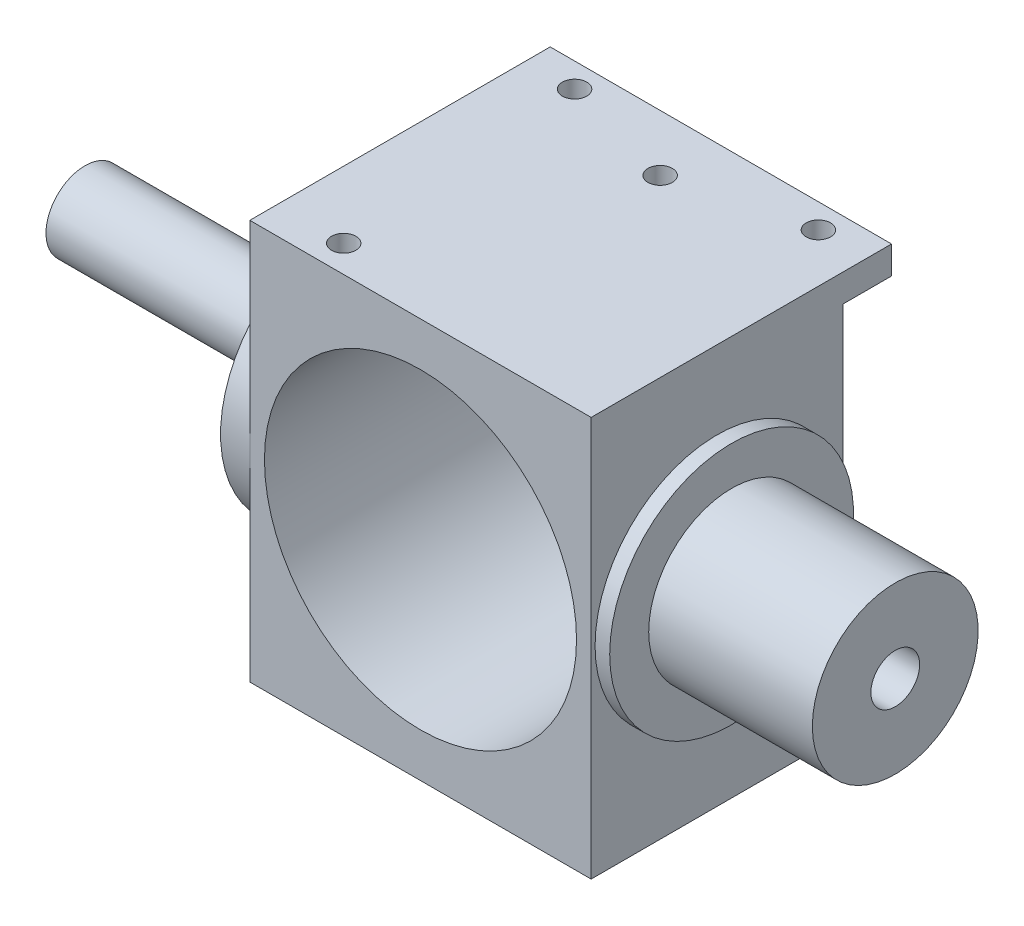
ISO-10303-21;
HEADER;
FILE_DESCRIPTION(('STEP AP214'),'2;1');
FILE_NAME('part.step','',(''),(''),'','','');
FILE_SCHEMA(('AUTOMOTIVE_DESIGN { 1 0 10303 214 1 1 1 1 }'));
ENDSEC;
DATA;
#1=APPLICATION_CONTEXT('core data for automotive mechanical design processes');
#2=APPLICATION_PROTOCOL_DEFINITION('international standard','automotive_design',2000,#1);
#3=PRODUCT_CONTEXT('',#1,'mechanical');
#4=PRODUCT('Part','Part','',(#3));
#5=PRODUCT_RELATED_PRODUCT_CATEGORY('part','',(#4));
#6=PRODUCT_DEFINITION_FORMATION('','',#4);
#7=PRODUCT_DEFINITION_CONTEXT('part definition',#1,'design');
#8=PRODUCT_DEFINITION('design','',#6,#7);
#9=PRODUCT_DEFINITION_SHAPE('','',#8);
#10=(LENGTH_UNIT() NAMED_UNIT(*) SI_UNIT(.MILLI.,.METRE.));
#11=(NAMED_UNIT(*) PLANE_ANGLE_UNIT() SI_UNIT($,.RADIAN.));
#12=(NAMED_UNIT(*) SI_UNIT($,.STERADIAN.) SOLID_ANGLE_UNIT());
#13=UNCERTAINTY_MEASURE_WITH_UNIT(LENGTH_MEASURE(1.E-05),#10,'distance_accuracy_value','');
#14=(GEOMETRIC_REPRESENTATION_CONTEXT(3) GLOBAL_UNCERTAINTY_ASSIGNED_CONTEXT((#13)) GLOBAL_UNIT_ASSIGNED_CONTEXT((#10,
#11,#12)) REPRESENTATION_CONTEXT('',''));
#15=CARTESIAN_POINT('',(0.,0.,0.));
#16=DIRECTION('',(0.,0.,1.));
#17=DIRECTION('',(1.,0.,0.));
#18=AXIS2_PLACEMENT_3D('',#15,#16,#17);
#19=CARTESIAN_POINT('',(53.5807438589496,27.618402196632,37.7129267767126));
#20=DIRECTION('',(-1.,0.,0.));
#21=DIRECTION('',(0.,0.,1.));
#22=AXIS2_PLACEMENT_3D('',#19,#20,#21);
#23=CYLINDRICAL_SURFACE('',#22,8.5);
#24=CARTESIAN_POINT('',(53.5807438589496,27.618402196632,37.7129267767126));
#25=DIRECTION('',(-1.,0.,0.));
#26=DIRECTION('',(0.,0.,1.));
#27=AXIS2_PLACEMENT_3D('',#24,#25,#26);
#28=CIRCLE('',#27,8.5);
#29=CARTESIAN_POINT('',(53.5807438589496,27.618402196632,46.2129267767126));
#30=VERTEX_POINT('',#29);
#31=EDGE_CURVE('E11',#30,#30,#28,.T.);
#32=ORIENTED_EDGE('',*,*,#31,.T.);
#33=EDGE_LOOP('',(#32));
#34=FACE_BOUND('',#33,.T.);
#35=CARTESIAN_POINT('',(36.7995438589496,27.618402196632,37.7129267767126));
#36=DIRECTION('',(-1.,0.,0.));
#37=DIRECTION('',(0.,0.,1.));
#38=AXIS2_PLACEMENT_3D('',#35,#36,#37);
#39=CIRCLE('',#38,8.5);
#40=CARTESIAN_POINT('',(36.7995438589496,27.618402196632,46.2129267767126));
#41=VERTEX_POINT('',#40);
#42=EDGE_CURVE('E58',#41,#41,#39,.T.);
#43=ORIENTED_EDGE('',*,*,#42,.F.);
#44=EDGE_LOOP('',(#43));
#45=FACE_BOUND('',#44,.T.);
#46=ADVANCED_FACE('F44',(#34,#45),#23,.T.);
#47=CARTESIAN_POINT('',(53.5807438589496,36.118402196632,37.7129267767126));
#48=DIRECTION('',(1.,0.,0.));
#49=DIRECTION('',(0.,0.,-1.));
#50=AXIS2_PLACEMENT_3D('',#47,#48,#49);
#51=PLANE('',#50);
#52=CARTESIAN_POINT('',(53.5807438589496,27.618402196632,37.7129267767126));
#53=DIRECTION('',(1.,0.,0.));
#54=DIRECTION('',(0.,0.,-1.));
#55=AXIS2_PLACEMENT_3D('',#52,#53,#54);
#56=CIRCLE('',#55,2.49999999999998);
#57=CARTESIAN_POINT('',(53.5807438589496,27.618402196632,35.2129267767126));
#58=VERTEX_POINT('',#57);
#59=EDGE_CURVE('E66',#58,#58,#56,.T.);
#60=ORIENTED_EDGE('',*,*,#59,.F.);
#61=EDGE_LOOP('',(#60));
#62=FACE_BOUND('',#61,.T.);
#63=ORIENTED_EDGE('',*,*,#31,.F.);
#64=EDGE_LOOP('',(#63));
#65=FACE_BOUND('',#64,.T.);
#66=ADVANCED_FACE('F73',(#62,#65),#51,.T.);
#67=CARTESIAN_POINT('',(35.2995438589496,27.618402196632,37.7129267767126));
#68=DIRECTION('',(-1.,0.,0.));
#69=DIRECTION('',(0.,0.,1.));
#70=AXIS2_PLACEMENT_3D('',#67,#68,#69);
#71=PLANE('',#70);
#72=CARTESIAN_POINT('',(35.2995438589496,27.618402196632,37.7129267767126));
#73=DIRECTION('',(-1.,0.,0.));
#74=DIRECTION('',(0.,0.,1.));
#75=AXIS2_PLACEMENT_3D('',#72,#73,#74);
#76=CIRCLE('',#75,2.49999999999998);
#77=CARTESIAN_POINT('',(35.2995438589496,27.618402196632,40.2129267767126));
#78=VERTEX_POINT('',#77);
#79=EDGE_CURVE('E63',#78,#78,#76,.T.);
#80=ORIENTED_EDGE('',*,*,#79,.F.);
#81=EDGE_LOOP('',(#80));
#82=FACE_BOUND('',#81,.T.);
#83=CARTESIAN_POINT('',(35.2995438589496,27.618402196632,37.7129267767126));
#84=DIRECTION('',(-1.,0.,0.));
#85=DIRECTION('',(0.,0.,1.));
#86=AXIS2_PLACEMENT_3D('',#83,#84,#85);
#87=CIRCLE('',#86,12.5);
#88=CARTESIAN_POINT('',(35.2995438589496,27.618402196632,50.2129267767126));
#89=VERTEX_POINT('',#88);
#90=EDGE_CURVE('E50',#89,#89,#87,.T.);
#91=ORIENTED_EDGE('',*,*,#90,.T.);
#92=EDGE_LOOP('',(#91));
#93=FACE_BOUND('',#92,.T.);
#94=ADVANCED_FACE('F76',(#82,#93),#71,.T.);
#95=CARTESIAN_POINT('',(53.5807438589496,27.618402196632,37.7129267767126));
#96=DIRECTION('',(-1.,0.,0.));
#97=DIRECTION('',(0.,0.,1.));
#98=AXIS2_PLACEMENT_3D('',#95,#96,#97);
#99=CYLINDRICAL_SURFACE('',#98,12.5);
#100=CARTESIAN_POINT('',(36.7995438589496,27.618402196632,37.7129267767126));
#101=DIRECTION('',(-1.,0.,0.));
#102=DIRECTION('',(0.,0.,1.));
#103=AXIS2_PLACEMENT_3D('',#100,#101,#102);
#104=CIRCLE('',#103,12.5);
#105=CARTESIAN_POINT('',(36.7995438589496,27.618402196632,50.2129267767126));
#106=VERTEX_POINT('',#105);
#107=EDGE_CURVE('E54',#106,#106,#104,.T.);
#108=ORIENTED_EDGE('',*,*,#107,.T.);
#109=EDGE_LOOP('',(#108));
#110=FACE_BOUND('',#109,.T.);
#111=ORIENTED_EDGE('',*,*,#90,.F.);
#112=EDGE_LOOP('',(#111));
#113=FACE_BOUND('',#112,.T.);
#114=ADVANCED_FACE('F81',(#110,#113),#99,.T.);
#115=CARTESIAN_POINT('',(36.7995438589496,40.118402196632,37.7129267767126));
#116=DIRECTION('',(1.,0.,0.));
#117=DIRECTION('',(0.,0.,-1.));
#118=AXIS2_PLACEMENT_3D('',#115,#116,#117);
#119=PLANE('',#118);
#120=ORIENTED_EDGE('',*,*,#42,.T.);
#121=EDGE_LOOP('',(#120));
#122=FACE_BOUND('',#121,.T.);
#123=ORIENTED_EDGE('',*,*,#107,.F.);
#124=EDGE_LOOP('',(#123));
#125=FACE_BOUND('',#124,.T.);
#126=ADVANCED_FACE('F87',(#122,#125),#119,.T.);
#127=CARTESIAN_POINT('',(53.5807438589496,27.618402196632,37.7129267767126));
#128=DIRECTION('',(1.,0.,0.));
#129=DIRECTION('',(0.,0.,-1.));
#130=AXIS2_PLACEMENT_3D('',#127,#128,#129);
#131=CYLINDRICAL_SURFACE('',#130,2.49999999999998);
#132=ORIENTED_EDGE('',*,*,#59,.T.);
#133=EDGE_LOOP('',(#132));
#134=FACE_BOUND('',#133,.T.);
#135=ORIENTED_EDGE('',*,*,#79,.T.);
#136=EDGE_LOOP('',(#135));
#137=FACE_BOUND('',#136,.T.);
#138=ADVANCED_FACE('F70',(#134,#137),#131,.F.);
#139=CLOSED_SHELL('',(#46,#66,#94,#114,#126,#138));
#140=MANIFOLD_SOLID_BREP('B2',#139);
#141=CARTESIAN_POINT('',(0.,0.,19.8129267767126));
#142=DIRECTION('',(0.,0.,-1.));
#143=DIRECTION('',(-1.,0.,0.));
#144=AXIS2_PLACEMENT_3D('',#141,#142,#143);
#145=PLANE('',#144);
#146=DIRECTION('',(-1.,0.,0.));
#147=VECTOR('',#146,1.);
#148=CARTESIAN_POINT('',(0.,10.118402196632,19.8129267767126));
#149=LINE('',#148,#147);
#150=CARTESIAN_POINT('',(35.2995438589496,10.118402196632,19.8129267767126));
#151=VERTEX_POINT('',#150);
#152=CARTESIAN_POINT('',(0.299543858949605,10.118402196632,19.8129267767126));
#153=VERTEX_POINT('',#152);
#154=EDGE_CURVE('E155',#151,#153,#149,.T.);
#155=ORIENTED_EDGE('',*,*,#154,.F.);
#156=DIRECTION('',(0.,-1.,0.));
#157=VECTOR('',#156,1.);
#158=CARTESIAN_POINT('',(35.2995438589496,48.118402196632,19.8129267767126));
#159=LINE('',#158,#157);
#160=CARTESIAN_POINT('',(35.2995438589496,7.11840219663202,19.8129267767126));
#161=VERTEX_POINT('',#160);
#162=EDGE_CURVE('E282',#151,#161,#159,.T.);
#163=ORIENTED_EDGE('',*,*,#162,.T.);
#164=DIRECTION('',(-1.,0.,0.));
#165=VECTOR('',#164,1.);
#166=CARTESIAN_POINT('',(35.2995438589496,7.11840219663202,19.8129267767126));
#167=LINE('',#166,#165);
#168=CARTESIAN_POINT('',(0.299543858949612,7.11840219663202,19.8129267767126));
#169=VERTEX_POINT('',#168);
#170=EDGE_CURVE('E266',#161,#169,#167,.T.);
#171=ORIENTED_EDGE('',*,*,#170,.T.);
#172=DIRECTION('',(0.,1.,0.));
#173=VECTOR('',#172,1.);
#174=CARTESIAN_POINT('',(0.299543858949612,7.11840219663202,19.8129267767126));
#175=LINE('',#174,#173);
#176=EDGE_CURVE('E276',#169,#153,#175,.T.);
#177=ORIENTED_EDGE('',*,*,#176,.T.);
#178=EDGE_LOOP('',(#155,#163,#171,#177));
#179=FACE_BOUND('',#178,.T.);
#180=ADVANCED_FACE('F143',(#179),#145,.T.);
#181=CARTESIAN_POINT('',(0.299543858949612,7.11840219663202,50.6129267767126));
#182=DIRECTION('',(-1.,0.,0.));
#183=DIRECTION('',(0.,-1.,0.));
#184=AXIS2_PLACEMENT_3D('',#181,#182,#183);
#185=PLANE('',#184);
#186=DIRECTION('',(0.,0.,1.));
#187=VECTOR('',#186,1.);
#188=CARTESIAN_POINT('',(0.299543858949612,10.118402196632,50.6129267767126));
#189=LINE('',#188,#187);
#190=CARTESIAN_POINT('',(0.299543858949609,10.118402196632,24.8129267767126));
#191=VERTEX_POINT('',#190);
#192=EDGE_CURVE('E257',#153,#191,#189,.T.);
#193=ORIENTED_EDGE('',*,*,#192,.F.);
#194=ORIENTED_EDGE('',*,*,#176,.F.);
#195=DIRECTION('',(0.,0.,-1.));
#196=VECTOR('',#195,1.);
#197=CARTESIAN_POINT('',(0.299543858949612,7.11840219663202,50.6129267767126));
#198=LINE('',#197,#196);
#199=CARTESIAN_POINT('',(0.299543858949612,7.11840219663202,50.6129267767126));
#200=VERTEX_POINT('',#199);
#201=EDGE_CURVE('E288',#200,#169,#198,.T.);
#202=ORIENTED_EDGE('',*,*,#201,.F.);
#203=DIRECTION('',(0.,1.,0.));
#204=VECTOR('',#203,1.);
#205=CARTESIAN_POINT('',(0.299543858949612,7.11840219663202,50.6129267767126));
#206=LINE('',#205,#204);
#207=CARTESIAN_POINT('',(0.299543858949605,48.118402196632,50.6129267767126));
#208=VERTEX_POINT('',#207);
#209=EDGE_CURVE('E262',#200,#208,#206,.T.);
#210=ORIENTED_EDGE('',*,*,#209,.T.);
#211=DIRECTION('',(0.,0.,-1.));
#212=VECTOR('',#211,1.);
#213=CARTESIAN_POINT('',(0.299543858949605,48.118402196632,50.6129267767126));
#214=LINE('',#213,#212);
#215=CARTESIAN_POINT('',(0.299543858949605,48.118402196632,19.8129267767126));
#216=VERTEX_POINT('',#215);
#217=EDGE_CURVE('E275',#208,#216,#214,.T.);
#218=ORIENTED_EDGE('',*,*,#217,.T.);
#219=CARTESIAN_POINT('',(0.299543858949606,45.272002196632,19.8129267767126));
#220=VERTEX_POINT('',#219);
#221=EDGE_CURVE('E261',#220,#216,#175,.T.);
#222=ORIENTED_EDGE('',*,*,#221,.F.);
#223=DIRECTION('',(0.,0.,-1.));
#224=VECTOR('',#223,1.);
#225=CARTESIAN_POINT('',(0.299543858949606,45.272002196632,50.6129267767126));
#226=LINE('',#225,#224);
#227=CARTESIAN_POINT('',(0.299543858949605,45.272002196632,24.8129267767126));
#228=VERTEX_POINT('',#227);
#229=EDGE_CURVE('E169',#228,#220,#226,.T.);
#230=ORIENTED_EDGE('',*,*,#229,.F.);
#231=DIRECTION('',(0.,1.,0.));
#232=VECTOR('',#231,1.);
#233=CARTESIAN_POINT('',(0.299543858949612,7.11840219663202,24.8129267767126));
#234=LINE('',#233,#232);
#235=EDGE_CURVE('E259',#191,#228,#234,.T.);
#236=ORIENTED_EDGE('',*,*,#235,.F.);
#237=EDGE_LOOP('',(#193,#194,#202,#210,#218,#222,#230,#236));
#238=FACE_BOUND('',#237,.T.);
#239=ADVANCED_FACE('F347',(#238),#185,.T.);
#240=CARTESIAN_POINT('',(35.2995438589496,7.11840219663202,50.6129267767126));
#241=DIRECTION('',(0.,-1.,0.));
#242=DIRECTION('',(0.,0.,-1.));
#243=AXIS2_PLACEMENT_3D('',#240,#241,#242);
#244=PLANE('',#243);
#245=CARTESIAN_POINT('',(5.29954385894961,7.11840219663201,22.3129267767126));
#246=DIRECTION('',(0.,1.,0.));
#247=DIRECTION('',(0.,0.,1.));
#248=AXIS2_PLACEMENT_3D('',#245,#246,#247);
#249=CIRCLE('',#248,1.24999999999997);
#250=CARTESIAN_POINT('',(5.29954385894961,7.11840219663201,23.5629267767126));
#251=VERTEX_POINT('',#250);
#252=EDGE_CURVE('E411',#251,#251,#249,.T.);
#253=ORIENTED_EDGE('',*,*,#252,.T.);
#254=EDGE_LOOP('',(#253));
#255=FACE_BOUND('',#254,.T.);
#256=CARTESIAN_POINT('',(30.2995438589496,7.11840219663202,22.3129267767126));
#257=DIRECTION('',(0.,1.,0.));
#258=DIRECTION('',(0.,0.,1.));
#259=AXIS2_PLACEMENT_3D('',#256,#257,#258);
#260=CIRCLE('',#259,1.24999999999997);
#261=CARTESIAN_POINT('',(30.2995438589496,7.11840219663201,23.5629267767126));
#262=VERTEX_POINT('',#261);
#263=EDGE_CURVE('E405',#262,#262,#260,.T.);
#264=ORIENTED_EDGE('',*,*,#263,.T.);
#265=EDGE_LOOP('',(#264));
#266=FACE_BOUND('',#265,.T.);
#267=ORIENTED_EDGE('',*,*,#170,.F.);
#268=DIRECTION('',(0.,0.,-1.));
#269=VECTOR('',#268,1.);
#270=CARTESIAN_POINT('',(35.2995438589496,7.11840219663202,50.6129267767126));
#271=LINE('',#270,#269);
#272=CARTESIAN_POINT('',(35.2995438589496,7.11840219663202,50.6129267767126));
#273=VERTEX_POINT('',#272);
#274=EDGE_CURVE('E291',#273,#161,#271,.T.);
#275=ORIENTED_EDGE('',*,*,#274,.F.);
#276=DIRECTION('',(-1.,0.,0.));
#277=VECTOR('',#276,1.);
#278=CARTESIAN_POINT('',(35.2995438589496,7.11840219663202,50.6129267767126));
#279=LINE('',#278,#277);
#280=EDGE_CURVE('E272',#273,#200,#279,.T.);
#281=ORIENTED_EDGE('',*,*,#280,.T.);
#282=ORIENTED_EDGE('',*,*,#201,.T.);
#283=EDGE_LOOP('',(#267,#275,#281,#282));
#284=FACE_BOUND('',#283,.T.);
#285=ADVANCED_FACE('F354',(#255,#266,#284),#244,.T.);
#286=CARTESIAN_POINT('',(35.2995438589496,48.118402196632,50.6129267767126));
#287=DIRECTION('',(1.,0.,0.));
#288=DIRECTION('',(0.,1.,0.));
#289=AXIS2_PLACEMENT_3D('',#286,#287,#288);
#290=PLANE('',#289);
#291=CARTESIAN_POINT('',(35.2995438589496,27.618402196632,37.7129267767126));
#292=DIRECTION('',(1.,0.,0.));
#293=DIRECTION('',(0.,1.,0.));
#294=AXIS2_PLACEMENT_3D('',#291,#292,#293);
#295=CIRCLE('',#294,2.49999999999998);
#296=CARTESIAN_POINT('',(35.2995438589496,30.118402196632,37.7129267767126));
#297=VERTEX_POINT('',#296);
#298=EDGE_CURVE('E243',#297,#297,#295,.T.);
#299=ORIENTED_EDGE('',*,*,#298,.F.);
#300=EDGE_LOOP('',(#299));
#301=FACE_BOUND('',#300,.T.);
#302=DIRECTION('',(0.,0.,-1.));
#303=VECTOR('',#302,1.);
#304=CARTESIAN_POINT('',(35.2995438589496,10.118402196632,24.8129267767126));
#305=LINE('',#304,#303);
#306=CARTESIAN_POINT('',(35.2995438589496,10.118402196632,24.8129267767126));
#307=VERTEX_POINT('',#306);
#308=EDGE_CURVE('E237',#307,#151,#305,.T.);
#309=ORIENTED_EDGE('',*,*,#308,.F.);
#310=DIRECTION('',(0.,-1.,0.));
#311=VECTOR('',#310,1.);
#312=CARTESIAN_POINT('',(35.2995438589496,45.272002196632,24.8129267767126));
#313=LINE('',#312,#311);
#314=CARTESIAN_POINT('',(35.2995438589496,45.272002196632,24.8129267767126));
#315=VERTEX_POINT('',#314);
#316=EDGE_CURVE('E249',#315,#307,#313,.T.);
#317=ORIENTED_EDGE('',*,*,#316,.F.);
#318=DIRECTION('',(0.,0.,1.));
#319=VECTOR('',#318,1.);
#320=CARTESIAN_POINT('',(35.2995438589496,45.272002196632,19.8129267767126));
#321=LINE('',#320,#319);
#322=CARTESIAN_POINT('',(35.2995438589496,45.272002196632,19.8129267767126));
#323=VERTEX_POINT('',#322);
#324=EDGE_CURVE('E240',#323,#315,#321,.T.);
#325=ORIENTED_EDGE('',*,*,#324,.F.);
#326=CARTESIAN_POINT('',(35.2995438589496,48.118402196632,19.8129267767126));
#327=VERTEX_POINT('',#326);
#328=EDGE_CURVE('E283',#327,#323,#159,.T.);
#329=ORIENTED_EDGE('',*,*,#328,.F.);
#330=DIRECTION('',(0.,0.,-1.));
#331=VECTOR('',#330,1.);
#332=CARTESIAN_POINT('',(35.2995438589496,48.118402196632,50.6129267767126));
#333=LINE('',#332,#331);
#334=CARTESIAN_POINT('',(35.2995438589496,48.118402196632,50.6129267767126));
#335=VERTEX_POINT('',#334);
#336=EDGE_CURVE('E294',#335,#327,#333,.T.);
#337=ORIENTED_EDGE('',*,*,#336,.F.);
#338=DIRECTION('',(0.,-1.,0.));
#339=VECTOR('',#338,1.);
#340=CARTESIAN_POINT('',(35.2995438589496,48.118402196632,50.6129267767126));
#341=LINE('',#340,#339);
#342=EDGE_CURVE('E269',#335,#273,#341,.T.);
#343=ORIENTED_EDGE('',*,*,#342,.T.);
#344=ORIENTED_EDGE('',*,*,#274,.T.);
#345=ORIENTED_EDGE('',*,*,#162,.F.);
#346=EDGE_LOOP('',(#309,#317,#325,#329,#337,#343,#344,#345));
#347=FACE_BOUND('',#346,.T.);
#348=ADVANCED_FACE('F383',(#301,#347),#290,.T.);
#349=CARTESIAN_POINT('',(0.299543858949605,48.118402196632,50.6129267767126));
#350=DIRECTION('',(0.,1.,0.));
#351=DIRECTION('',(0.,0.,1.));
#352=AXIS2_PLACEMENT_3D('',#349,#350,#351);
#353=PLANE('',#352);
#354=CARTESIAN_POINT('',(5.29954385894961,48.118402196632,22.3129267767126));
#355=DIRECTION('',(0.,-1.,0.));
#356=DIRECTION('',(0.,0.,-1.));
#357=AXIS2_PLACEMENT_3D('',#354,#355,#356);
#358=CIRCLE('',#357,1.24999999999998);
#359=CARTESIAN_POINT('',(5.29954385894961,48.118402196632,21.0629267767126));
#360=VERTEX_POINT('',#359);
#361=EDGE_CURVE('E399',#360,#360,#358,.T.);
#362=ORIENTED_EDGE('',*,*,#361,.T.);
#363=EDGE_LOOP('',(#362));
#364=FACE_BOUND('',#363,.T.);
#365=CARTESIAN_POINT('',(30.2995438589496,48.118402196632,22.3129267767126));
#366=DIRECTION('',(0.,-1.,0.));
#367=DIRECTION('',(0.,0.,-1.));
#368=AXIS2_PLACEMENT_3D('',#365,#366,#367);
#369=CIRCLE('',#368,1.24999999999998);
#370=CARTESIAN_POINT('',(30.2995438589496,48.118402196632,21.0629267767126));
#371=VERTEX_POINT('',#370);
#372=EDGE_CURVE('E393',#371,#371,#369,.T.);
#373=ORIENTED_EDGE('',*,*,#372,.T.);
#374=EDGE_LOOP('',(#373));
#375=FACE_BOUND('',#374,.T.);
#376=CARTESIAN_POINT('',(17.3495438589496,48.118402196632,25.5879267767126));
#377=DIRECTION('',(0.,1.,0.));
#378=DIRECTION('',(0.,0.,1.));
#379=AXIS2_PLACEMENT_3D('',#376,#377,#378);
#380=CIRCLE('',#379,1.24999999999999);
#381=CARTESIAN_POINT('',(17.3495438589496,48.118402196632,26.8379267767126));
#382=VERTEX_POINT('',#381);
#383=EDGE_CURVE('E234',#382,#382,#380,.T.);
#384=ORIENTED_EDGE('',*,*,#383,.F.);
#385=EDGE_LOOP('',(#384));
#386=FACE_BOUND('',#385,.T.);
#387=CARTESIAN_POINT('',(7.1495438589496,48.118402196632,47.8379267767126));
#388=DIRECTION('',(0.,1.,0.));
#389=DIRECTION('',(0.,0.,1.));
#390=AXIS2_PLACEMENT_3D('',#387,#388,#389);
#391=CIRCLE('',#390,1.24999999999998);
#392=CARTESIAN_POINT('',(7.1495438589496,48.118402196632,49.0879267767126));
#393=VERTEX_POINT('',#392);
#394=EDGE_CURVE('E308',#393,#393,#391,.T.);
#395=ORIENTED_EDGE('',*,*,#394,.F.);
#396=EDGE_LOOP('',(#395));
#397=FACE_BOUND('',#396,.T.);
#398=DIRECTION('',(1.,0.,0.));
#399=VECTOR('',#398,1.);
#400=CARTESIAN_POINT('',(0.299543858949605,48.118402196632,19.8129267767126));
#401=LINE('',#400,#399);
#402=EDGE_CURVE('E279',#216,#327,#401,.T.);
#403=ORIENTED_EDGE('',*,*,#402,.F.);
#404=ORIENTED_EDGE('',*,*,#217,.F.);
#405=DIRECTION('',(1.,0.,0.));
#406=VECTOR('',#405,1.);
#407=CARTESIAN_POINT('',(0.299543858949605,48.118402196632,50.6129267767126));
#408=LINE('',#407,#406);
#409=EDGE_CURVE('E265',#208,#335,#408,.T.);
#410=ORIENTED_EDGE('',*,*,#409,.T.);
#411=ORIENTED_EDGE('',*,*,#336,.T.);
#412=EDGE_LOOP('',(#403,#404,#410,#411));
#413=FACE_BOUND('',#412,.T.);
#414=ADVANCED_FACE('F369',(#364,#375,#386,#397,#413),#353,.T.);
#415=CARTESIAN_POINT('',(0.,0.,50.6129267767126));
#416=DIRECTION('',(0.,0.,-1.));
#417=DIRECTION('',(-1.,0.,0.));
#418=AXIS2_PLACEMENT_3D('',#415,#416,#417);
#419=PLANE('',#418);
#420=CARTESIAN_POINT('',(17.7995438589496,27.618402196632,50.6129267767126));
#421=DIRECTION('',(0.,0.,1.));
#422=DIRECTION('',(1.,0.,0.));
#423=AXIS2_PLACEMENT_3D('',#420,#421,#422);
#424=CIRCLE('',#423,16.);
#425=CARTESIAN_POINT('',(33.7995438589496,27.618402196632,50.6129267767126));
#426=VERTEX_POINT('',#425);
#427=EDGE_CURVE('E238',#426,#426,#424,.T.);
#428=ORIENTED_EDGE('',*,*,#427,.F.);
#429=EDGE_LOOP('',(#428));
#430=FACE_BOUND('',#429,.T.);
#431=ORIENTED_EDGE('',*,*,#209,.F.);
#432=ORIENTED_EDGE('',*,*,#280,.F.);
#433=ORIENTED_EDGE('',*,*,#342,.F.);
#434=ORIENTED_EDGE('',*,*,#409,.F.);
#435=EDGE_LOOP('',(#431,#432,#433,#434));
#436=FACE_BOUND('',#435,.T.);
#437=ADVANCED_FACE('F361',(#430,#436),#419,.F.);
#438=DIRECTION('',(1.,0.,0.));
#439=VECTOR('',#438,1.);
#440=CARTESIAN_POINT('',(0.,45.272002196632,19.8129267767126));
#441=LINE('',#440,#439);
#442=EDGE_CURVE('E290',#220,#323,#441,.T.);
#443=ORIENTED_EDGE('',*,*,#442,.F.);
#444=ORIENTED_EDGE('',*,*,#221,.T.);
#445=ORIENTED_EDGE('',*,*,#402,.T.);
#446=ORIENTED_EDGE('',*,*,#328,.T.);
#447=EDGE_LOOP('',(#443,#444,#445,#446));
#448=FACE_BOUND('',#447,.T.);
#449=ADVANCED_FACE('F350',(#448),#145,.T.);
#450=CARTESIAN_POINT('',(-29.5004561410504,10.118402196632,24.8129267767126));
#451=DIRECTION('',(0.,-1.,0.));
#452=DIRECTION('',(0.,0.,-1.));
#453=AXIS2_PLACEMENT_3D('',#450,#451,#452);
#454=PLANE('',#453);
#455=CARTESIAN_POINT('',(5.29954385894961,10.118402196632,22.3129267767126));
#456=DIRECTION('',(0.,1.,0.));
#457=DIRECTION('',(0.,0.,1.));
#458=AXIS2_PLACEMENT_3D('',#455,#456,#457);
#459=CIRCLE('',#458,1.24999999999997);
#460=CARTESIAN_POINT('',(5.29954385894961,10.118402196632,23.5629267767126));
#461=VERTEX_POINT('',#460);
#462=EDGE_CURVE('E414',#461,#461,#459,.T.);
#463=ORIENTED_EDGE('',*,*,#462,.F.);
#464=EDGE_LOOP('',(#463));
#465=FACE_BOUND('',#464,.T.);
#466=CARTESIAN_POINT('',(30.2995438589496,10.118402196632,22.3129267767126));
#467=DIRECTION('',(0.,1.,0.));
#468=DIRECTION('',(0.,0.,1.));
#469=AXIS2_PLACEMENT_3D('',#466,#467,#468);
#470=CIRCLE('',#469,1.24999999999997);
#471=CARTESIAN_POINT('',(30.2995438589496,10.118402196632,23.5629267767126));
#472=VERTEX_POINT('',#471);
#473=EDGE_CURVE('E408',#472,#472,#470,.T.);
#474=ORIENTED_EDGE('',*,*,#473,.F.);
#475=EDGE_LOOP('',(#474));
#476=FACE_BOUND('',#475,.T.);
#477=ORIENTED_EDGE('',*,*,#192,.T.);
#478=DIRECTION('',(1.,0.,0.));
#479=VECTOR('',#478,1.);
#480=CARTESIAN_POINT('',(-29.5004561410504,10.118402196632,24.8129267767126));
#481=LINE('',#480,#479);
#482=EDGE_CURVE('E253',#191,#307,#481,.T.);
#483=ORIENTED_EDGE('',*,*,#482,.T.);
#484=ORIENTED_EDGE('',*,*,#308,.T.);
#485=ORIENTED_EDGE('',*,*,#154,.T.);
#486=EDGE_LOOP('',(#477,#483,#484,#485));
#487=FACE_BOUND('',#486,.T.);
#488=ADVANCED_FACE('F360',(#465,#476,#487),#454,.F.);
#489=CARTESIAN_POINT('',(-29.5004561410504,45.272002196632,24.8129267767126));
#490=DIRECTION('',(0.,0.,1.));
#491=DIRECTION('',(1.,0.,0.));
#492=AXIS2_PLACEMENT_3D('',#489,#490,#491);
#493=PLANE('',#492);
#494=CARTESIAN_POINT('',(17.7995438589496,27.618402196632,24.8129267767126));
#495=DIRECTION('',(0.,0.,1.));
#496=DIRECTION('',(1.,0.,0.));
#497=AXIS2_PLACEMENT_3D('',#494,#495,#496);
#498=CIRCLE('',#497,16.);
#499=CARTESIAN_POINT('',(16.3687915966529,43.554303425114,24.8129267767126));
#500=VERTEX_POINT('',#499);
#501=CARTESIAN_POINT('',(18.3302961212462,43.6095967122418,24.8129267767126));
#502=VERTEX_POINT('',#501);
#503=EDGE_CURVE('E231',#500,#502,#498,.T.);
#504=ORIENTED_EDGE('',*,*,#503,.T.);
#505=DIRECTION('',(0.,1.,0.));
#506=VECTOR('',#505,1.);
#507=CARTESIAN_POINT('',(18.3302961212462,48.118402196632,24.8129267767126));
#508=LINE('',#507,#506);
#509=CARTESIAN_POINT('',(18.3302961212462,45.272002196632,24.8129267767126));
#510=VERTEX_POINT('',#509);
#511=EDGE_CURVE('E162',#502,#510,#508,.T.);
#512=ORIENTED_EDGE('',*,*,#511,.T.);
#513=DIRECTION('',(1.,0.,0.));
#514=VECTOR('',#513,1.);
#515=CARTESIAN_POINT('',(-29.5004561410504,45.272002196632,24.8129267767126));
#516=LINE('',#515,#514);
#517=EDGE_CURVE('E252',#510,#315,#516,.T.);
#518=ORIENTED_EDGE('',*,*,#517,.T.);
#519=ORIENTED_EDGE('',*,*,#316,.T.);
#520=ORIENTED_EDGE('',*,*,#482,.F.);
#521=ORIENTED_EDGE('',*,*,#235,.T.);
#522=CARTESIAN_POINT('',(16.3687915966529,45.272002196632,24.8129267767126));
#523=VERTEX_POINT('',#522);
#524=EDGE_CURVE('E232',#228,#523,#516,.T.);
#525=ORIENTED_EDGE('',*,*,#524,.T.);
#526=DIRECTION('',(0.,1.,0.));
#527=VECTOR('',#526,1.);
#528=CARTESIAN_POINT('',(16.3687915966529,48.118402196632,24.8129267767126));
#529=LINE('',#528,#527);
#530=EDGE_CURVE('E223',#523,#500,#529,.F.);
#531=ORIENTED_EDGE('',*,*,#530,.T.);
#532=EDGE_LOOP('',(#504,#512,#518,#519,#520,#521,#525,#531));
#533=FACE_BOUND('',#532,.T.);
#534=ADVANCED_FACE('F230',(#533),#493,.F.);
#535=CARTESIAN_POINT('',(-29.5004561410504,45.272002196632,19.8129267767126));
#536=DIRECTION('',(0.,1.,0.));
#537=DIRECTION('',(-1.,0.,0.));
#538=AXIS2_PLACEMENT_3D('',#535,#536,#537);
#539=PLANE('',#538);
#540=CARTESIAN_POINT('',(5.29954385894961,45.272002196632,22.3129267767126));
#541=DIRECTION('',(0.,-1.,0.));
#542=DIRECTION('',(0.,0.,-1.));
#543=AXIS2_PLACEMENT_3D('',#540,#541,#542);
#544=CIRCLE('',#543,1.24999999999998);
#545=CARTESIAN_POINT('',(5.29954385894961,45.272002196632,21.0629267767126));
#546=VERTEX_POINT('',#545);
#547=EDGE_CURVE('E402',#546,#546,#544,.T.);
#548=ORIENTED_EDGE('',*,*,#547,.F.);
#549=EDGE_LOOP('',(#548));
#550=FACE_BOUND('',#549,.T.);
#551=CARTESIAN_POINT('',(30.2995438589496,45.272002196632,22.3129267767126));
#552=DIRECTION('',(0.,-1.,0.));
#553=DIRECTION('',(0.,0.,-1.));
#554=AXIS2_PLACEMENT_3D('',#551,#552,#553);
#555=CIRCLE('',#554,1.24999999999998);
#556=CARTESIAN_POINT('',(30.2995438589496,45.272002196632,21.0629267767126));
#557=VERTEX_POINT('',#556);
#558=EDGE_CURVE('E396',#557,#557,#555,.T.);
#559=ORIENTED_EDGE('',*,*,#558,.F.);
#560=EDGE_LOOP('',(#559));
#561=FACE_BOUND('',#560,.T.);
#562=ORIENTED_EDGE('',*,*,#517,.F.);
#563=CARTESIAN_POINT('',(17.3495438589496,45.272002196632,25.5879267767126));
#564=DIRECTION('',(0.,1.,0.));
#565=DIRECTION('',(-1.,0.,0.));
#566=AXIS2_PLACEMENT_3D('',#563,#564,#565);
#567=CIRCLE('',#566,1.24999999999999);
#568=EDGE_CURVE('E233',#510,#523,#567,.T.);
#569=ORIENTED_EDGE('',*,*,#568,.T.);
#570=ORIENTED_EDGE('',*,*,#524,.F.);
#571=ORIENTED_EDGE('',*,*,#229,.T.);
#572=ORIENTED_EDGE('',*,*,#442,.T.);
#573=ORIENTED_EDGE('',*,*,#324,.T.);
#574=EDGE_LOOP('',(#562,#569,#570,#571,#572,#573));
#575=FACE_BOUND('',#574,.T.);
#576=ADVANCED_FACE('F386',(#550,#561,#575),#539,.F.);
#577=CARTESIAN_POINT('',(17.7995438589496,27.618402196632,50.6129267767126));
#578=DIRECTION('',(0.,0.,1.));
#579=DIRECTION('',(1.,0.,0.));
#580=AXIS2_PLACEMENT_3D('',#577,#578,#579);
#581=CYLINDRICAL_SURFACE('',#580,16.);
#582=CARTESIAN_POINT('',(7.1495438589496,39.5589842594965,49.0879267767126));
#583=CARTESIAN_POINT('',(7.22841025100024,39.6293251701633,49.0879275253317));
#584=CARTESIAN_POINT('',(7.30801002333441,39.698910166747,49.08047969827));
#585=CARTESIAN_POINT('',(7.46693001150936,39.8351136817398,49.0496689824288));
#586=CARTESIAN_POINT('',(7.54624984198888,39.9017289803233,49.0262892464861));
#587=CARTESIAN_POINT('',(7.68975799179025,40.0199943000132,48.9673982728999));
#588=CARTESIAN_POINT('',(7.75437030918428,40.0723540012027,48.9343609677214));
#589=CARTESIAN_POINT('',(7.87937715397783,40.1721529773538,48.8554186510015));
#590=CARTESIAN_POINT('',(7.93977830909945,40.2196000438861,48.8095344568639));
#591=CARTESIAN_POINT('',(8.04276631192002,40.2994395481597,48.7146130681844));
#592=CARTESIAN_POINT('',(8.08655324117426,40.3329771122049,48.6678478873446));
#593=CARTESIAN_POINT('',(8.16778471078857,40.3946228060148,48.5658877298161));
#594=CARTESIAN_POINT('',(8.20523034999038,40.4227318765673,48.5106942167782));
#595=CARTESIAN_POINT('',(8.27201780499601,40.472506841842,48.3921953522042));
#596=CARTESIAN_POINT('',(8.30128811795272,40.4941160060748,48.3288251076241));
#597=CARTESIAN_POINT('',(8.34919589073696,40.5293209234379,48.196107665322));
#598=CARTESIAN_POINT('',(8.36784493226361,40.5429254056111,48.1267670731977));
#599=CARTESIAN_POINT('',(8.39114320016101,40.5598924741225,47.9951784021133));
#600=CARTESIAN_POINT('',(8.39743922291544,40.5644606379411,47.9333734130613));
#601=CARTESIAN_POINT('',(8.40075279348468,40.5668667450301,47.8093958469466));
#602=CARTESIAN_POINT('',(8.39777496674115,40.5647080434035,47.7472234685632));
#603=CARTESIAN_POINT('',(8.38334866905531,40.5542181614103,47.6294308083059));
#604=CARTESIAN_POINT('',(8.37258362792708,40.5463849207979,47.5736793567642));
#605=CARTESIAN_POINT('',(8.34396222356784,40.5254656824477,47.4650743830946));
#606=CARTESIAN_POINT('',(8.32610549028107,40.512379410598,47.4122210123571));
#607=CARTESIAN_POINT('',(8.28334498692651,40.4808548240629,47.3085258478892));
#608=CARTESIAN_POINT('',(8.25818969789309,40.4622247385429,47.2578471001296));
#609=CARTESIAN_POINT('',(8.20230107823198,40.4205170932762,47.1616876948797));
#610=CARTESIAN_POINT('',(8.17156587882845,40.3974380433598,47.1162087872172));
#611=CARTESIAN_POINT('',(8.10134576865354,40.344247170049,47.025347406109));
#612=CARTESIAN_POINT('',(8.06124242559233,40.3136105796767,46.9807524146164));
#613=CARTESIAN_POINT('',(7.97684548102725,40.2484240475169,46.8990281016199));
#614=CARTESIAN_POINT('',(7.93254845026406,40.2138708984492,46.8619049688993));
#615=CARTESIAN_POINT('',(7.81961523435933,40.1247326528481,46.7794290813128));
#616=CARTESIAN_POINT('',(7.74928034563387,40.0683333193814,46.7383400798698));
#617=CARTESIAN_POINT('',(7.6054217740488,39.95082067727,46.6713099764106));
#618=CARTESIAN_POINT('',(7.5318934842693,39.8897004520584,46.6453915963067));
#619=CARTESIAN_POINT('',(7.38288887726279,39.7634819211845,46.6074635743204));
#620=CARTESIAN_POINT('',(7.30739969500392,39.6983399901176,46.5956531662439));
#621=CARTESIAN_POINT('',(7.15718685347285,39.5662162814578,46.5856843743714));
#622=CARTESIAN_POINT('',(7.08246332223114,39.4992342028366,46.5875282376759));
#623=CARTESIAN_POINT('',(6.91951180305149,39.3503879507891,46.6059935028791));
#624=CARTESIAN_POINT('',(6.83176211160093,39.2683664850097,46.6256516282157));
#625=CARTESIAN_POINT('',(6.66133793649691,39.105536022258,46.6836889019518));
#626=CARTESIAN_POINT('',(6.57866491578456,39.0247273798062,46.722073418485));
#627=CARTESIAN_POINT('',(6.43830312811785,38.8847138147371,46.807484169759));
#628=CARTESIAN_POINT('',(6.37913112623724,38.8246817970776,46.8507248449842));
#629=CARTESIAN_POINT('',(6.26696272096157,38.7092092340625,46.9495991043031));
#630=CARTESIAN_POINT('',(6.21395505594591,38.6537603711311,47.0052095307402));
#631=CARTESIAN_POINT('',(6.13101740222701,38.5659134165647,47.1111616260617));
#632=CARTESIAN_POINT('',(6.09890763765558,38.5315586189827,47.1581675970786));
#633=CARTESIAN_POINT('',(6.04022893092636,38.468303741791,47.2588726012257));
#634=CARTESIAN_POINT('',(6.01365193214192,38.4393957366561,47.3125617178046));
#635=CARTESIAN_POINT('',(5.97245995508199,38.3943394137828,47.4144479850031));
#636=CARTESIAN_POINT('',(5.95650734785193,38.3767882823249,47.4614763656665));
#637=CARTESIAN_POINT('',(5.93006427076985,38.3476074193715,47.5588117203578));
#638=CARTESIAN_POINT('',(5.91956915507387,38.3359726515913,47.60911586461));
#639=CARTESIAN_POINT('',(5.90479866785438,38.3195780633947,47.7121089936214));
#640=CARTESIAN_POINT('',(5.90056510508215,38.3148644574719,47.7648116084974));
#641=CARTESIAN_POINT('',(5.89885201901788,38.3129586031203,47.8704596380682));
#642=CARTESIAN_POINT('',(5.90137083096406,38.3157645007981,47.9234049897047));
#643=CARTESIAN_POINT('',(5.91231678050375,38.3279253282249,48.0222889647668));
#644=CARTESIAN_POINT('',(5.92011141338537,38.33657901696,48.0683892581831));
#645=CARTESIAN_POINT('',(5.94039892872743,38.359021805115,48.158227751732));
#646=CARTESIAN_POINT('',(5.95289387106696,38.3728131560552,48.2019649066102));
#647=CARTESIAN_POINT('',(5.98734876645245,38.4106640631441,48.3022171082816));
#648=CARTESIAN_POINT('',(6.01110089364877,38.4366348479417,48.3573928539733));
#649=CARTESIAN_POINT('',(6.06452385931679,38.4945626035896,48.4613572409776));
#650=CARTESIAN_POINT('',(6.09420670064754,38.5265317059906,48.5101325917028));
#651=CARTESIAN_POINT('',(6.17129496245318,38.6087683708878,48.6200435683575));
#652=CARTESIAN_POINT('',(6.22096517015398,38.661150209285,48.6779987903182));
#653=CARTESIAN_POINT('',(6.3267767978002,38.7710469336774,48.7818917912596));
#654=CARTESIAN_POINT('',(6.38293255031589,38.8285731225007,48.827802190824));
#655=CARTESIAN_POINT('',(6.51923298766611,38.9659448808494,48.9214910875595));
#656=CARTESIAN_POINT('',(6.60120687301811,39.046925059265,48.9649481359937));
#657=CARTESIAN_POINT('',(6.77074093327827,39.2106145811297,49.0326314192226));
#658=CARTESIAN_POINT('',(6.85829159626268,39.2933208266517,49.0568894991045));
#659=CARTESIAN_POINT('',(7.01408372181703,39.437119089,49.0823876313112));
#660=CARTESIAN_POINT('',(7.08154116421908,39.498332677108,49.0879261312143));
#661=CARTESIAN_POINT('',(7.1495438589496,39.5589842594965,49.0879267767126));
#662=B_SPLINE_CURVE_WITH_KNOTS('',3,(#582,#583,#584,#585,#586,#587,#588,#589,#590,#591,#592,
#593,#594,#595,#596,#597,#598,#599,#600,#601,#602,#603,#604,#605,#606,#607,#608,#609,#610,#611,
#612,#613,#614,#615,#616,#617,#618,#619,#620,#621,#622,#623,#624,#625,#626,#627,#628,#629,#630,
#631,#632,#633,#634,#635,#636,#637,#638,#639,#640,#641,#642,#643,#644,#645,#646,#647,#648,#649,
#650,#651,#652,#653,#654,#655,#656,#657,#658,#659,#660,#661),.UNSPECIFIED.,.T.,.F.,(4,2,2,2,2,2,
2,2,2,2,2,2,2,2,2,2,2,2,2,2,2,2,2,2,2,2,2,2,2,2,2,2,2,2,2,2,2,2,2,4),(0.,0.316814175904855,
0.633963887220631,0.901435157842406,1.1684754954178,1.38456423085952,1.60061548326066,
1.81850106767839,2.03614860708912,2.22201079301226,2.40778029283002,2.57896409915326,
2.75015683929324,2.92814275109768,3.10618838275649,3.30747462438697,3.50892690722588,
3.80453994105443,4.10059460601332,4.40078253410515,4.70101986559696,5.06462343256464,
5.42833129194084,5.71164548914288,5.99443368671965,6.19328291343825,6.3918405253364,
6.54923647496252,6.70649821658051,6.86480533659751,7.02307343043248,7.16510825347536,
7.30720539497996,7.50245010582682,7.69809403933429,7.97429766100385,8.25112379294263,
8.61869949574288,8.98566422005234,9.25883783849965),.UNSPECIFIED.);
#663=CARTESIAN_POINT('',(7.1495438589496,39.5589842594965,49.0879267767126));
#664=VERTEX_POINT('',#663);
#665=EDGE_CURVE('E304',#664,#664,#662,.T.);
#666=ORIENTED_EDGE('',*,*,#665,.T.);
#667=EDGE_LOOP('',(#666));
#668=FACE_BOUND('',#667,.T.);
#669=ORIENTED_EDGE('',*,*,#427,.T.);
#670=EDGE_LOOP('',(#669));
#671=FACE_BOUND('',#670,.T.);
#672=ORIENTED_EDGE('',*,*,#503,.F.);
#673=CARTESIAN_POINT('',(16.3687915966529,43.554303425114,24.8129267767126));
#674=CARTESIAN_POINT('',(16.3470555958181,43.552351773371,24.8404339301807));
#675=CARTESIAN_POINT('',(16.3264852357546,43.550460293576,24.8688453221694));
#676=CARTESIAN_POINT('',(16.2877984372048,43.5468360107551,24.9273009818201));
#677=CARTESIAN_POINT('',(16.2696819470202,43.5451032043864,24.9573452150626));
#678=CARTESIAN_POINT('',(16.2192440052578,43.5402048404949,25.049577674157));
#679=CARTESIAN_POINT('',(16.1907713010789,43.5373335448865,25.1139452454446));
#680=CARTESIAN_POINT('',(16.1450040461206,43.5326421069366,25.2465834351924));
#681=CARTESIAN_POINT('',(16.1277162131873,43.5308225963871,25.3148563725488));
#682=CARTESIAN_POINT('',(16.1048313179303,43.5284016810724,25.453345970764));
#683=CARTESIAN_POINT('',(16.0992309935825,43.527799936426,25.5235620837304));
#684=CARTESIAN_POINT('',(16.0998827567662,43.5278695689244,25.6637023386862));
#685=CARTESIAN_POINT('',(16.1060955607488,43.5285367264455,25.733626676139));
#686=CARTESIAN_POINT('',(16.1301133516421,43.531074679085,25.8714447583443));
#687=CARTESIAN_POINT('',(16.1479203087023,43.532945678767,25.9393381559359));
#688=CARTESIAN_POINT('',(16.194605599654,43.5377212696764,26.0711509094684));
#689=CARTESIAN_POINT('',(16.2234819506855,43.5406256757831,26.1350709747703));
#690=CARTESIAN_POINT('',(16.2914755139076,43.5472091652997,26.2571604132863));
#691=CARTESIAN_POINT('',(16.3305923189259,43.5508882179076,26.3153300150188));
#692=CARTESIAN_POINT('',(16.4181671265433,43.558720079748,26.4245630948589));
#693=CARTESIAN_POINT('',(16.4666676402443,43.562875008498,26.475592339571));
#694=CARTESIAN_POINT('',(16.5715292108036,43.5712935073739,26.5688011594896));
#695=CARTESIAN_POINT('',(16.6278906193149,43.5755570823531,26.6109803385816));
#696=CARTESIAN_POINT('',(16.747106548918,43.5838634510737,26.6854354692875));
#697=CARTESIAN_POINT('',(16.8099831227411,43.5879054191424,26.7176762140382));
#698=CARTESIAN_POINT('',(16.9402912100834,43.5954463473251,26.7711306809631));
#699=CARTESIAN_POINT('',(17.0077226536761,43.5989453157725,26.7923445723782));
#700=CARTESIAN_POINT('',(17.145128383849,43.6051611138204,26.8231043368117));
#701=CARTESIAN_POINT('',(17.2150988170127,43.6078790770762,26.8326671877546));
#702=CARTESIAN_POINT('',(17.3556806445187,43.6123988944274,26.8398915928367));
#703=CARTESIAN_POINT('',(17.4262920259262,43.6142007669687,26.8375533866208));
#704=CARTESIAN_POINT('',(17.5658823539597,43.6168477375432,26.8210607817274));
#705=CARTESIAN_POINT('',(17.6348662360259,43.6176962346432,26.8069486762187));
#706=CARTESIAN_POINT('',(17.769496996323,43.6185156902505,26.7673598900674));
#707=CARTESIAN_POINT('',(17.8351438957903,43.6184866543431,26.7418832817582));
#708=CARTESIAN_POINT('',(17.9611773467712,43.6177099039483,26.6803181067481));
#709=CARTESIAN_POINT('',(18.0215686248416,43.616962842644,26.6442392055924));
#710=CARTESIAN_POINT('',(18.1354526791286,43.6149772764805,26.5624835357937));
#711=CARTESIAN_POINT('',(18.1889453587379,43.61373876474,26.5168066327649));
#712=CARTESIAN_POINT('',(18.287617585924,43.6110326982966,26.4170519932389));
#713=CARTESIAN_POINT('',(18.3327814451594,43.6095647207814,26.3629587497145));
#714=CARTESIAN_POINT('',(18.4133972825201,43.6066734107369,26.2479621880788));
#715=CARTESIAN_POINT('',(18.4488491696758,43.6052500786257,26.1870588061861));
#716=CARTESIAN_POINT('',(18.5090709268702,43.6026909002911,26.0600912940928));
#717=CARTESIAN_POINT('',(18.5338287182624,43.6015553797367,25.9940214274249));
#718=CARTESIAN_POINT('',(18.5718965516394,43.5997612622435,25.8586597948608));
#719=CARTESIAN_POINT('',(18.5852073024519,43.5991026357748,25.7893682287399));
#720=CARTESIAN_POINT('',(18.5999952841497,43.5983688284465,25.6496067116069));
#721=CARTESIAN_POINT('',(18.6014852058601,43.5982930218751,25.5791381057665));
#722=CARTESIAN_POINT('',(18.5926180075804,43.5987354877604,25.4389254714714));
#723=CARTESIAN_POINT('',(18.5822569708835,43.5992539566235,25.3691816902581));
#724=CARTESIAN_POINT('',(18.5499880566041,43.6008016583793,25.2324371490002));
#725=CARTESIAN_POINT('',(18.5280799510801,43.6018309013547,25.1654364431326));
#726=CARTESIAN_POINT('',(18.4733460184998,43.6042313422569,25.0361283368703));
#727=CARTESIAN_POINT('',(18.4405374703457,43.6056019981357,24.9738136988333));
#728=CARTESIAN_POINT('',(18.3915653731996,43.6074495630204,24.8971813642279));
#729=CARTESIAN_POINT('',(18.3798920658255,43.6078781777285,24.8798879108123));
#730=CARTESIAN_POINT('',(18.3557144283795,43.6087374262501,24.8459341672868));
#731=CARTESIAN_POINT('',(18.3432114717955,43.6091680556813,24.8292728990989));
#732=CARTESIAN_POINT('',(18.3302961212462,43.6095967122418,24.8129267767126));
#733=B_SPLINE_CURVE_WITH_KNOTS('',3,(#673,#674,#675,#676,#677,#678,#679,#680,#681,#682,#683,
#684,#685,#686,#687,#688,#689,#690,#691,#692,#693,#694,#695,#696,#697,#698,#699,#700,#701,#702,
#703,#704,#705,#706,#707,#708,#709,#710,#711,#712,#713,#714,#715,#716,#717,#718,#719,#720,#721,
#722,#723,#724,#725,#726,#727,#728,#729,#730,#731,#732),.UNSPECIFIED.,.F.,.F.,(4,2,2,2,2,2,2,2,
2,2,2,2,2,2,2,2,2,2,2,2,2,2,2,2,2,2,2,2,2,4),(0.,0.105274204101358,0.210546189932064,
0.420789422495154,0.631158814197986,0.841469483219326,1.05108200500612,1.26073015473451,
1.47034076773599,1.67994304764414,1.89051811826017,2.10110261186459,2.31242474735667,
2.5237436393669,2.73475422725081,2.94576056615004,3.15601219366487,3.36626248297843,
3.57632168981316,3.78638383797601,3.99683770986433,4.20729355295802,4.41798648171531,
4.6286663629337,4.83912002788745,5.04964326726078,5.26017066256328,5.47036591874527,
5.53295519355891,5.59544331899557),.UNSPECIFIED.);
#734=EDGE_CURVE('E42',#500,#502,#733,.T.);
#735=ORIENTED_EDGE('',*,*,#734,.T.);
#736=EDGE_LOOP('',(#672,#735));
#737=FACE_BOUND('',#736,.T.);
#738=ADVANCED_FACE('F236',(#668,#671,#737),#581,.F.);
#739=CARTESIAN_POINT('',(35.2985438589496,27.618402196632,37.7129267767126));
#740=DIRECTION('',(-1.,0.,0.));
#741=DIRECTION('',(0.,0.,1.));
#742=AXIS2_PLACEMENT_3D('',#739,#740,#741);
#743=PLANE('',#742);
#744=CARTESIAN_POINT('',(35.2985438589496,27.618402196632,37.7129267767126));
#745=DIRECTION('',(1.,0.,0.));
#746=DIRECTION('',(0.,0.,-1.));
#747=AXIS2_PLACEMENT_3D('',#744,#745,#746);
#748=CIRCLE('',#747,2.49999999999998);
#749=CARTESIAN_POINT('',(35.2985438589496,27.618402196632,35.2129267767126));
#750=VERTEX_POINT('',#749);
#751=EDGE_CURVE('E300',#750,#750,#748,.T.);
#752=ORIENTED_EDGE('',*,*,#751,.T.);
#753=EDGE_LOOP('',(#752));
#754=FACE_BOUND('',#753,.T.);
#755=ADVANCED_FACE('F457',(#754),#743,.F.);
#756=CARTESIAN_POINT('',(53.5807438589496,27.618402196632,37.7129267767126));
#757=DIRECTION('',(1.,0.,0.));
#758=DIRECTION('',(0.,0.,-1.));
#759=AXIS2_PLACEMENT_3D('',#756,#757,#758);
#760=CYLINDRICAL_SURFACE('',#759,2.49999999999998);
#761=ORIENTED_EDGE('',*,*,#298,.T.);
#762=EDGE_LOOP('',(#761));
#763=FACE_BOUND('',#762,.T.);
#764=ORIENTED_EDGE('',*,*,#751,.F.);
#765=EDGE_LOOP('',(#764));
#766=FACE_BOUND('',#765,.T.);
#767=ADVANCED_FACE('F322',(#763,#766),#760,.F.);
#768=CARTESIAN_POINT('',(7.1495438589496,48.118402196632,47.8379267767126));
#769=DIRECTION('',(0.,1.,0.));
#770=DIRECTION('',(0.,0.,1.));
#771=AXIS2_PLACEMENT_3D('',#768,#769,#770);
#772=CYLINDRICAL_SURFACE('',#771,1.24999999999997);
#773=ORIENTED_EDGE('',*,*,#665,.F.);
#774=EDGE_LOOP('',(#773));
#775=FACE_BOUND('',#774,.T.);
#776=ORIENTED_EDGE('',*,*,#394,.T.);
#777=EDGE_LOOP('',(#776));
#778=FACE_BOUND('',#777,.T.);
#779=ADVANCED_FACE('F318',(#775,#778),#772,.F.);
#780=CARTESIAN_POINT('',(17.3495438589496,48.118402196632,25.5879267767126));
#781=DIRECTION('',(0.,1.,0.));
#782=DIRECTION('',(0.,0.,1.));
#783=AXIS2_PLACEMENT_3D('',#780,#781,#782);
#784=CYLINDRICAL_SURFACE('',#783,1.24999999999999);
#785=ORIENTED_EDGE('',*,*,#383,.T.);
#786=EDGE_LOOP('',(#785));
#787=FACE_BOUND('',#786,.T.);
#788=ORIENTED_EDGE('',*,*,#734,.F.);
#789=ORIENTED_EDGE('',*,*,#530,.F.);
#790=ORIENTED_EDGE('',*,*,#568,.F.);
#791=ORIENTED_EDGE('',*,*,#511,.F.);
#792=EDGE_LOOP('',(#788,#789,#790,#791));
#793=FACE_BOUND('',#792,.T.);
#794=ADVANCED_FACE('F222',(#787,#793),#784,.F.);
#795=CARTESIAN_POINT('',(30.2995438589496,45.272002196632,22.3129267767126));
#796=DIRECTION('',(0.,-1.,0.));
#797=DIRECTION('',(0.,0.,-1.));
#798=AXIS2_PLACEMENT_3D('',#795,#796,#797);
#799=CYLINDRICAL_SURFACE('',#798,1.24999999999998);
#800=ORIENTED_EDGE('',*,*,#372,.F.);
#801=EDGE_LOOP('',(#800));
#802=FACE_BOUND('',#801,.T.);
#803=ORIENTED_EDGE('',*,*,#558,.T.);
#804=EDGE_LOOP('',(#803));
#805=FACE_BOUND('',#804,.T.);
#806=ADVANCED_FACE('F326',(#802,#805),#799,.F.);
#807=CARTESIAN_POINT('',(5.29954385894961,45.272002196632,22.3129267767126));
#808=DIRECTION('',(0.,-1.,0.));
#809=DIRECTION('',(0.,0.,-1.));
#810=AXIS2_PLACEMENT_3D('',#807,#808,#809);
#811=CYLINDRICAL_SURFACE('',#810,1.24999999999998);
#812=ORIENTED_EDGE('',*,*,#361,.F.);
#813=EDGE_LOOP('',(#812));
#814=FACE_BOUND('',#813,.T.);
#815=ORIENTED_EDGE('',*,*,#547,.T.);
#816=EDGE_LOOP('',(#815));
#817=FACE_BOUND('',#816,.T.);
#818=ADVANCED_FACE('F330',(#814,#817),#811,.F.);
#819=CARTESIAN_POINT('',(30.2995438589496,10.118402196632,22.3129267767126));
#820=DIRECTION('',(0.,1.,0.));
#821=DIRECTION('',(0.,0.,1.));
#822=AXIS2_PLACEMENT_3D('',#819,#820,#821);
#823=CYLINDRICAL_SURFACE('',#822,1.24999999999997);
#824=ORIENTED_EDGE('',*,*,#263,.F.);
#825=EDGE_LOOP('',(#824));
#826=FACE_BOUND('',#825,.T.);
#827=ORIENTED_EDGE('',*,*,#473,.T.);
#828=EDGE_LOOP('',(#827));
#829=FACE_BOUND('',#828,.T.);
#830=ADVANCED_FACE('F334',(#826,#829),#823,.F.);
#831=CARTESIAN_POINT('',(5.29954385894961,10.118402196632,22.3129267767126));
#832=DIRECTION('',(0.,1.,0.));
#833=DIRECTION('',(0.,0.,1.));
#834=AXIS2_PLACEMENT_3D('',#831,#832,#833);
#835=CYLINDRICAL_SURFACE('',#834,1.24999999999997);
#836=ORIENTED_EDGE('',*,*,#252,.F.);
#837=EDGE_LOOP('',(#836));
#838=FACE_BOUND('',#837,.T.);
#839=ORIENTED_EDGE('',*,*,#462,.T.);
#840=EDGE_LOOP('',(#839));
#841=FACE_BOUND('',#840,.T.);
#842=ADVANCED_FACE('F338',(#838,#841),#835,.F.);
#843=CLOSED_SHELL('',(#180,#239,#285,#348,#414,#437,#449,#488,#534,#576,#738,#755,#767,#779,
#794,#806,#818,#830,#842));
#844=MANIFOLD_SOLID_BREP('B6',#843);
#845=CARTESIAN_POINT('',(-29.5004561410504,27.618402196632,37.7129267767126));
#846=DIRECTION('',(1.,0.,0.));
#847=DIRECTION('',(0.,1.,0.));
#848=AXIS2_PLACEMENT_3D('',#845,#846,#847);
#849=CYLINDRICAL_SURFACE('',#848,4.00000000000001);
#850=CARTESIAN_POINT('',(-29.5004561410504,27.618402196632,37.7129267767126));
#851=DIRECTION('',(1.,0.,0.));
#852=DIRECTION('',(0.,1.,0.));
#853=AXIS2_PLACEMENT_3D('',#850,#851,#852);
#854=CIRCLE('',#853,4.00000000000001);
#855=CARTESIAN_POINT('',(-29.5004561410504,31.618402196632,37.7129267767126));
#856=VERTEX_POINT('',#855);
#857=EDGE_CURVE('E142',#856,#856,#854,.T.);
#858=ORIENTED_EDGE('',*,*,#857,.T.);
#859=EDGE_LOOP('',(#858));
#860=FACE_BOUND('',#859,.T.);
#861=CARTESIAN_POINT('',(-4.20045614100673,27.618402196632,37.7129267767126));
#862=DIRECTION('',(1.,0.,0.));
#863=DIRECTION('',(0.,1.,0.));
#864=AXIS2_PLACEMENT_3D('',#861,#862,#863);
#865=CIRCLE('',#864,4.00000000000001);
#866=CARTESIAN_POINT('',(-4.20045614100673,31.618402196632,37.7129267767126));
#867=VERTEX_POINT('',#866);
#868=EDGE_CURVE('E596',#867,#867,#865,.T.);
#869=ORIENTED_EDGE('',*,*,#868,.F.);
#870=EDGE_LOOP('',(#869));
#871=FACE_BOUND('',#870,.T.);
#872=ADVANCED_FACE('F577',(#860,#871),#849,.T.);
#873=CARTESIAN_POINT('',(-29.5004561410504,31.618402196632,37.7129267767126));
#874=DIRECTION('',(-1.,0.,0.));
#875=DIRECTION('',(0.,-1.,0.));
#876=AXIS2_PLACEMENT_3D('',#873,#874,#875);
#877=PLANE('',#876);
#878=ORIENTED_EDGE('',*,*,#857,.F.);
#879=EDGE_LOOP('',(#878));
#880=FACE_BOUND('',#879,.T.);
#881=ADVANCED_FACE('F604',(#880),#877,.T.);
#882=CARTESIAN_POINT('',(0.299543858949607,27.618402196632,37.7129267767126));
#883=DIRECTION('',(1.,0.,0.));
#884=DIRECTION('',(0.,1.,0.));
#885=AXIS2_PLACEMENT_3D('',#882,#883,#884);
#886=PLANE('',#885);
#887=CARTESIAN_POINT('',(0.299543858949609,27.618402196632,37.7129267767126));
#888=DIRECTION('',(1.,0.,0.));
#889=DIRECTION('',(0.,1.,0.));
#890=AXIS2_PLACEMENT_3D('',#887,#888,#889);
#891=CIRCLE('',#890,12.8999999999034);
#892=CARTESIAN_POINT('',(0.299543858949604,40.5184021965354,37.7129267767126));
#893=VERTEX_POINT('',#892);
#894=EDGE_CURVE('E583',#893,#893,#891,.T.);
#895=ORIENTED_EDGE('',*,*,#894,.T.);
#896=EDGE_LOOP('',(#895));
#897=FACE_BOUND('',#896,.T.);
#898=ADVANCED_FACE('F608',(#897),#886,.T.);
#899=CARTESIAN_POINT('',(-29.5004561410504,27.618402196632,37.7129267767126));
#900=DIRECTION('',(1.,0.,0.));
#901=DIRECTION('',(0.,1.,0.));
#902=AXIS2_PLACEMENT_3D('',#899,#900,#901);
#903=CYLINDRICAL_SURFACE('',#902,12.8999999999034);
#904=CARTESIAN_POINT('',(-2.70045614114602,27.618402196632,37.7129267767126));
#905=DIRECTION('',(1.,0.,0.));
#906=DIRECTION('',(0.,1.,0.));
#907=AXIS2_PLACEMENT_3D('',#904,#905,#906);
#908=CIRCLE('',#907,12.8999999999034);
#909=CARTESIAN_POINT('',(-2.70045614114602,40.5184021965354,37.7129267767126));
#910=VERTEX_POINT('',#909);
#911=EDGE_CURVE('E587',#910,#910,#908,.T.);
#912=ORIENTED_EDGE('',*,*,#911,.T.);
#913=EDGE_LOOP('',(#912));
#914=FACE_BOUND('',#913,.T.);
#915=ORIENTED_EDGE('',*,*,#894,.F.);
#916=EDGE_LOOP('',(#915));
#917=FACE_BOUND('',#916,.T.);
#918=ADVANCED_FACE('F613',(#914,#917),#903,.T.);
#919=CARTESIAN_POINT('',(-2.70045614114602,40.5184021965354,37.7129267767126));
#920=DIRECTION('',(-1.,0.,0.));
#921=DIRECTION('',(0.,-1.,0.));
#922=AXIS2_PLACEMENT_3D('',#919,#920,#921);
#923=PLANE('',#922);
#924=CARTESIAN_POINT('',(-2.70045614114602,27.618402196632,37.7129267767126));
#925=DIRECTION('',(1.,0.,0.));
#926=DIRECTION('',(0.,1.,0.));
#927=AXIS2_PLACEMENT_3D('',#924,#925,#926);
#928=CIRCLE('',#927,5.49999999986071);
#929=CARTESIAN_POINT('',(-2.70045614114602,33.1184021964927,37.7129267767126));
#930=VERTEX_POINT('',#929);
#931=EDGE_CURVE('E591',#930,#930,#928,.T.);
#932=ORIENTED_EDGE('',*,*,#931,.T.);
#933=EDGE_LOOP('',(#932));
#934=FACE_BOUND('',#933,.T.);
#935=ORIENTED_EDGE('',*,*,#911,.F.);
#936=EDGE_LOOP('',(#935));
#937=FACE_BOUND('',#936,.T.);
#938=ADVANCED_FACE('F618',(#934,#937),#923,.T.);
#939=CARTESIAN_POINT('',(-2.70045614114602,27.618402196632,37.7129267767126));
#940=DIRECTION('',(1.,0.,0.));
#941=DIRECTION('',(0.,1.,0.));
#942=AXIS2_PLACEMENT_3D('',#939,#940,#941);
#943=CONICAL_SURFACE('',#942,5.49999999986071,0.785398163397447);
#944=ORIENTED_EDGE('',*,*,#868,.T.);
#945=EDGE_LOOP('',(#944));
#946=FACE_BOUND('',#945,.T.);
#947=ORIENTED_EDGE('',*,*,#931,.F.);
#948=EDGE_LOOP('',(#947));
#949=FACE_BOUND('',#948,.T.);
#950=ADVANCED_FACE('F600',(#946,#949),#943,.T.);
#951=CLOSED_SHELL('',(#872,#881,#898,#918,#938,#950));
#952=MANIFOLD_SOLID_BREP('B36',#951);
#953=ADVANCED_BREP_SHAPE_REPRESENTATION('',(#18,#140,#844,#952),#14);
#954=SHAPE_DEFINITION_REPRESENTATION(#9,#953);
ENDSEC;
END-ISO-10303-21;
